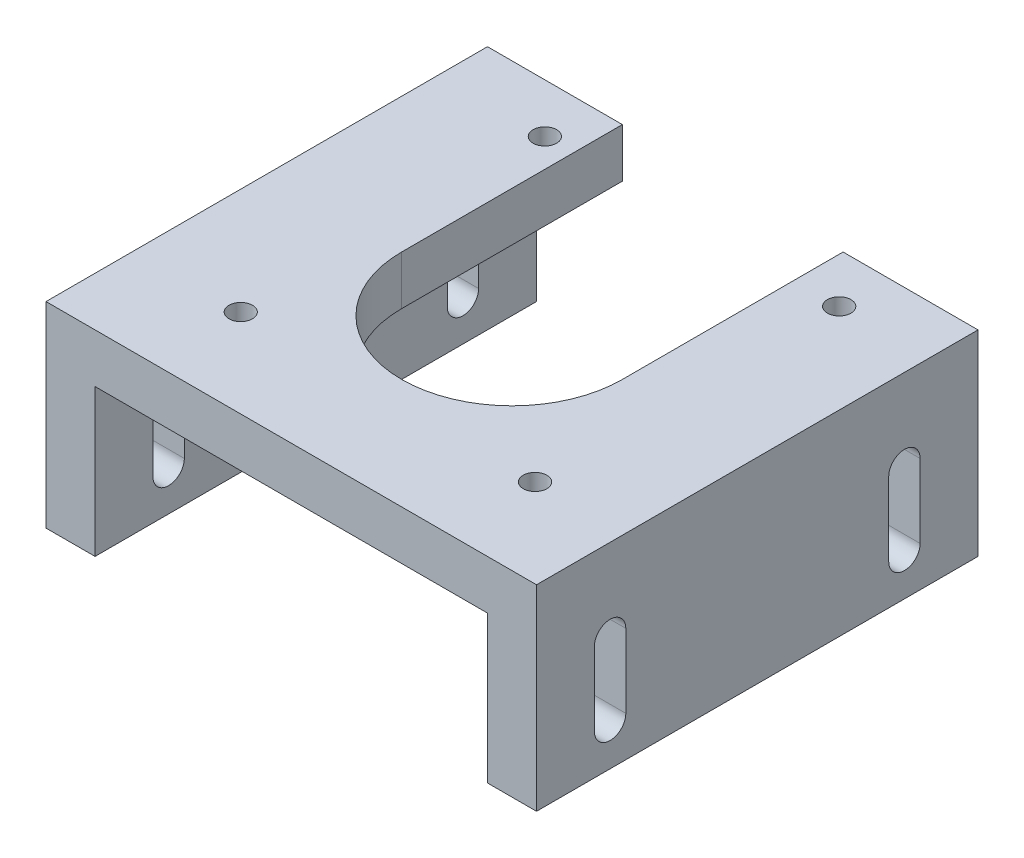
ISO-10303-21;
HEADER;
FILE_DESCRIPTION(('STEP AP214'),'2;1');
FILE_NAME('part.step','',(''),(''),'','','');
FILE_SCHEMA(('AUTOMOTIVE_DESIGN { 1 0 10303 214 1 1 1 1 }'));
ENDSEC;
DATA;
#1=APPLICATION_CONTEXT('core data for automotive mechanical design processes');
#2=APPLICATION_PROTOCOL_DEFINITION('international standard','automotive_design',2000,#1);
#3=PRODUCT_CONTEXT('',#1,'mechanical');
#4=PRODUCT('Part','Part','',(#3));
#5=PRODUCT_RELATED_PRODUCT_CATEGORY('part','',(#4));
#6=PRODUCT_DEFINITION_FORMATION('','',#4);
#7=PRODUCT_DEFINITION_CONTEXT('part definition',#1,'design');
#8=PRODUCT_DEFINITION('design','',#6,#7);
#9=PRODUCT_DEFINITION_SHAPE('','',#8);
#10=(LENGTH_UNIT() NAMED_UNIT(*) SI_UNIT(.MILLI.,.METRE.));
#11=(NAMED_UNIT(*) PLANE_ANGLE_UNIT() SI_UNIT($,.RADIAN.));
#12=(NAMED_UNIT(*) SI_UNIT($,.STERADIAN.) SOLID_ANGLE_UNIT());
#13=UNCERTAINTY_MEASURE_WITH_UNIT(LENGTH_MEASURE(1.E-05),#10,'distance_accuracy_value','');
#14=(GEOMETRIC_REPRESENTATION_CONTEXT(3) GLOBAL_UNCERTAINTY_ASSIGNED_CONTEXT((#13)) GLOBAL_UNIT_ASSIGNED_CONTEXT((#10,
#11,#12)) REPRESENTATION_CONTEXT('',''));
#15=CARTESIAN_POINT('',(0.,0.,0.));
#16=DIRECTION('',(0.,0.,1.));
#17=DIRECTION('',(1.,0.,0.));
#18=AXIS2_PLACEMENT_3D('',#15,#16,#17);
#19=CARTESIAN_POINT('',(0.,0.,0.));
#20=DIRECTION('',(0.,0.,1.));
#21=DIRECTION('',(1.,0.,0.));
#22=AXIS2_PLACEMENT_3D('',#19,#20,#21);
#23=PLANE('',#22);
#24=DIRECTION('',(1.,0.,0.));
#25=VECTOR('',#24,1.);
#26=CARTESIAN_POINT('',(-20.,15.,0.));
#27=LINE('',#26,#25);
#28=CARTESIAN_POINT('',(11.25,15.,0.));
#29=VERTEX_POINT('',#28);
#30=CARTESIAN_POINT('',(20.,15.,0.));
#31=VERTEX_POINT('',#30);
#32=EDGE_CURVE('E341',#29,#31,#27,.T.);
#33=ORIENTED_EDGE('',*,*,#32,.F.);
#34=DIRECTION('',(0.,1.,0.));
#35=VECTOR('',#34,1.);
#36=CARTESIAN_POINT('',(11.25,-0.001000000000001,0.));
#37=LINE('',#36,#35);
#38=CARTESIAN_POINT('',(11.25,20.,0.));
#39=VERTEX_POINT('',#38);
#40=EDGE_CURVE('E297',#29,#39,#37,.T.);
#41=ORIENTED_EDGE('',*,*,#40,.T.);
#42=DIRECTION('',(-1.,0.,0.));
#43=VECTOR('',#42,1.);
#44=CARTESIAN_POINT('',(25.,20.,0.));
#45=LINE('',#44,#43);
#46=CARTESIAN_POINT('',(25.,20.,0.));
#47=VERTEX_POINT('',#46);
#48=EDGE_CURVE('E332',#47,#39,#45,.T.);
#49=ORIENTED_EDGE('',*,*,#48,.F.);
#50=DIRECTION('',(0.,1.,0.));
#51=VECTOR('',#50,1.);
#52=CARTESIAN_POINT('',(25.,0.,0.));
#53=LINE('',#52,#51);
#54=CARTESIAN_POINT('',(25.,0.,0.));
#55=VERTEX_POINT('',#54);
#56=EDGE_CURVE('E329',#55,#47,#53,.T.);
#57=ORIENTED_EDGE('',*,*,#56,.F.);
#58=DIRECTION('',(1.,0.,0.));
#59=VECTOR('',#58,1.);
#60=CARTESIAN_POINT('',(20.,0.,0.));
#61=LINE('',#60,#59);
#62=CARTESIAN_POINT('',(20.,0.,0.));
#63=VERTEX_POINT('',#62);
#64=EDGE_CURVE('E307',#63,#55,#61,.T.);
#65=ORIENTED_EDGE('',*,*,#64,.F.);
#66=DIRECTION('',(0.,-1.,0.));
#67=VECTOR('',#66,1.);
#68=CARTESIAN_POINT('',(20.,15.,0.));
#69=LINE('',#68,#67);
#70=EDGE_CURVE('E312',#31,#63,#69,.T.);
#71=ORIENTED_EDGE('',*,*,#70,.F.);
#72=EDGE_LOOP('',(#33,#41,#49,#57,#65,#71));
#73=FACE_BOUND('',#72,.T.);
#74=ADVANCED_FACE('F35',(#73),#23,.F.);
#75=CARTESIAN_POINT('',(20.,0.,45.));
#76=DIRECTION('',(0.,1.,0.));
#77=DIRECTION('',(-1.,0.,0.));
#78=AXIS2_PLACEMENT_3D('',#75,#76,#77);
#79=PLANE('',#78);
#80=ORIENTED_EDGE('',*,*,#64,.T.);
#81=DIRECTION('',(0.,0.,-1.));
#82=VECTOR('',#81,1.);
#83=CARTESIAN_POINT('',(25.,0.,45.));
#84=LINE('',#83,#82);
#85=CARTESIAN_POINT('',(25.,0.,45.));
#86=VERTEX_POINT('',#85);
#87=EDGE_CURVE('E366',#86,#55,#84,.T.);
#88=ORIENTED_EDGE('',*,*,#87,.F.);
#89=DIRECTION('',(1.,0.,0.));
#90=VECTOR('',#89,1.);
#91=CARTESIAN_POINT('',(20.,0.,45.));
#92=LINE('',#91,#90);
#93=CARTESIAN_POINT('',(20.,0.,45.));
#94=VERTEX_POINT('',#93);
#95=EDGE_CURVE('E308',#94,#86,#92,.T.);
#96=ORIENTED_EDGE('',*,*,#95,.F.);
#97=DIRECTION('',(0.,0.,-1.));
#98=VECTOR('',#97,1.);
#99=CARTESIAN_POINT('',(20.,0.,45.));
#100=LINE('',#99,#98);
#101=EDGE_CURVE('E326',#94,#63,#100,.T.);
#102=ORIENTED_EDGE('',*,*,#101,.T.);
#103=EDGE_LOOP('',(#80,#88,#96,#102));
#104=FACE_BOUND('',#103,.T.);
#105=ADVANCED_FACE('F37',(#104),#79,.F.);
#106=CARTESIAN_POINT('',(25.,0.,45.));
#107=DIRECTION('',(-1.,0.,0.));
#108=DIRECTION('',(0.,0.,1.));
#109=AXIS2_PLACEMENT_3D('',#106,#107,#108);
#110=PLANE('',#109);
#111=DIRECTION('',(0.,1.,0.));
#112=VECTOR('',#111,1.);
#113=CARTESIAN_POINT('',(25.,11.6,39.1));
#114=LINE('',#113,#112);
#115=CARTESIAN_POINT('',(25.,11.6,39.1));
#116=VERTEX_POINT('',#115);
#117=CARTESIAN_POINT('',(25.,4.1,39.1));
#118=VERTEX_POINT('',#117);
#119=EDGE_CURVE('E254',#116,#118,#114,.F.);
#120=ORIENTED_EDGE('',*,*,#119,.F.);
#121=CARTESIAN_POINT('',(25.,11.6,37.5));
#122=DIRECTION('',(1.,0.,0.));
#123=DIRECTION('',(0.,0.,-1.));
#124=AXIS2_PLACEMENT_3D('',#121,#122,#123);
#125=CIRCLE('',#124,1.6);
#126=CARTESIAN_POINT('',(25.,11.6,35.9));
#127=VERTEX_POINT('',#126);
#128=EDGE_CURVE('E39',#127,#116,#125,.T.);
#129=ORIENTED_EDGE('',*,*,#128,.F.);
#130=DIRECTION('',(0.,1.,0.));
#131=VECTOR('',#130,1.);
#132=CARTESIAN_POINT('',(25.,11.6,35.9));
#133=LINE('',#132,#131);
#134=CARTESIAN_POINT('',(25.,4.1,35.9));
#135=VERTEX_POINT('',#134);
#136=EDGE_CURVE('E86',#135,#127,#133,.T.);
#137=ORIENTED_EDGE('',*,*,#136,.F.);
#138=CARTESIAN_POINT('',(25.,4.1,37.5));
#139=DIRECTION('',(1.,0.,0.));
#140=DIRECTION('',(0.,0.,-1.));
#141=AXIS2_PLACEMENT_3D('',#138,#139,#140);
#142=CIRCLE('',#141,1.6);
#143=EDGE_CURVE('E229',#118,#135,#142,.T.);
#144=ORIENTED_EDGE('',*,*,#143,.F.);
#145=EDGE_LOOP('',(#120,#129,#137,#144));
#146=FACE_BOUND('',#145,.T.);
#147=DIRECTION('',(0.,1.,0.));
#148=VECTOR('',#147,1.);
#149=CARTESIAN_POINT('',(25.,11.6,9.1));
#150=LINE('',#149,#148);
#151=CARTESIAN_POINT('',(25.,11.6,9.1));
#152=VERTEX_POINT('',#151);
#153=CARTESIAN_POINT('',(25.,4.1,9.1));
#154=VERTEX_POINT('',#153);
#155=EDGE_CURVE('E241',#152,#154,#150,.F.);
#156=ORIENTED_EDGE('',*,*,#155,.F.);
#157=CARTESIAN_POINT('',(25.,11.6,7.5));
#158=DIRECTION('',(1.,0.,0.));
#159=DIRECTION('',(0.,0.,-1.));
#160=AXIS2_PLACEMENT_3D('',#157,#158,#159);
#161=CIRCLE('',#160,1.6);
#162=CARTESIAN_POINT('',(25.,11.6,5.9));
#163=VERTEX_POINT('',#162);
#164=EDGE_CURVE('E251',#163,#152,#161,.T.);
#165=ORIENTED_EDGE('',*,*,#164,.F.);
#166=DIRECTION('',(0.,1.,0.));
#167=VECTOR('',#166,1.);
#168=CARTESIAN_POINT('',(25.,11.6,5.9));
#169=LINE('',#168,#167);
#170=CARTESIAN_POINT('',(25.,4.1,5.9));
#171=VERTEX_POINT('',#170);
#172=EDGE_CURVE('E247',#171,#163,#169,.T.);
#173=ORIENTED_EDGE('',*,*,#172,.F.);
#174=CARTESIAN_POINT('',(25.,4.1,7.5));
#175=DIRECTION('',(1.,0.,0.));
#176=DIRECTION('',(0.,0.,-1.));
#177=AXIS2_PLACEMENT_3D('',#174,#175,#176);
#178=CIRCLE('',#177,1.6);
#179=EDGE_CURVE('E191',#154,#171,#178,.T.);
#180=ORIENTED_EDGE('',*,*,#179,.F.);
#181=EDGE_LOOP('',(#156,#165,#173,#180));
#182=FACE_BOUND('',#181,.T.);
#183=ORIENTED_EDGE('',*,*,#56,.T.);
#184=DIRECTION('',(0.,0.,-1.));
#185=VECTOR('',#184,1.);
#186=CARTESIAN_POINT('',(25.,20.,45.));
#187=LINE('',#186,#185);
#188=CARTESIAN_POINT('',(25.,20.,45.));
#189=VERTEX_POINT('',#188);
#190=EDGE_CURVE('E363',#189,#47,#187,.T.);
#191=ORIENTED_EDGE('',*,*,#190,.F.);
#192=DIRECTION('',(0.,1.,0.));
#193=VECTOR('',#192,1.);
#194=CARTESIAN_POINT('',(25.,0.,45.));
#195=LINE('',#194,#193);
#196=EDGE_CURVE('E311',#86,#189,#195,.T.);
#197=ORIENTED_EDGE('',*,*,#196,.F.);
#198=ORIENTED_EDGE('',*,*,#87,.T.);
#199=EDGE_LOOP('',(#183,#191,#197,#198));
#200=FACE_BOUND('',#199,.T.);
#201=ADVANCED_FACE('F504',(#146,#182,#200),#110,.F.);
#202=CARTESIAN_POINT('',(25.,20.,45.));
#203=DIRECTION('',(0.,-1.,0.));
#204=DIRECTION('',(0.,0.,-1.));
#205=AXIS2_PLACEMENT_3D('',#202,#203,#204);
#206=PLANE('',#205);
#207=CARTESIAN_POINT('',(15.85,20.,5.));
#208=DIRECTION('',(0.,1.,0.));
#209=DIRECTION('',(0.,0.,1.));
#210=AXIS2_PLACEMENT_3D('',#207,#208,#209);
#211=CIRCLE('',#210,1.2);
#212=CARTESIAN_POINT('',(15.85,20.,6.2));
#213=VERTEX_POINT('',#212);
#214=EDGE_CURVE('E275',#213,#213,#211,.T.);
#215=ORIENTED_EDGE('',*,*,#214,.F.);
#216=EDGE_LOOP('',(#215));
#217=FACE_BOUND('',#216,.T.);
#218=CARTESIAN_POINT('',(-14.15,20.,5.));
#219=DIRECTION('',(0.,1.,0.));
#220=DIRECTION('',(0.,0.,1.));
#221=AXIS2_PLACEMENT_3D('',#218,#219,#220);
#222=CIRCLE('',#221,1.2);
#223=CARTESIAN_POINT('',(-14.15,20.,6.2));
#224=VERTEX_POINT('',#223);
#225=EDGE_CURVE('E272',#224,#224,#222,.T.);
#226=ORIENTED_EDGE('',*,*,#225,.F.);
#227=EDGE_LOOP('',(#226));
#228=FACE_BOUND('',#227,.T.);
#229=CARTESIAN_POINT('',(-14.15,20.,36.));
#230=DIRECTION('',(0.,1.,0.));
#231=DIRECTION('',(0.,0.,1.));
#232=AXIS2_PLACEMENT_3D('',#229,#230,#231);
#233=CIRCLE('',#232,1.2);
#234=CARTESIAN_POINT('',(-14.15,20.,37.2));
#235=VERTEX_POINT('',#234);
#236=EDGE_CURVE('E268',#235,#235,#233,.T.);
#237=ORIENTED_EDGE('',*,*,#236,.F.);
#238=EDGE_LOOP('',(#237));
#239=FACE_BOUND('',#238,.T.);
#240=CARTESIAN_POINT('',(15.85,20.,36.));
#241=DIRECTION('',(0.,1.,0.));
#242=DIRECTION('',(0.,0.,1.));
#243=AXIS2_PLACEMENT_3D('',#240,#241,#242);
#244=CIRCLE('',#243,1.2);
#245=CARTESIAN_POINT('',(15.85,20.,37.2));
#246=VERTEX_POINT('',#245);
#247=EDGE_CURVE('E271',#246,#246,#244,.T.);
#248=ORIENTED_EDGE('',*,*,#247,.F.);
#249=EDGE_LOOP('',(#248));
#250=FACE_BOUND('',#249,.T.);
#251=ORIENTED_EDGE('',*,*,#48,.T.);
#252=DIRECTION('',(0.,0.,-1.));
#253=VECTOR('',#252,1.);
#254=CARTESIAN_POINT('',(11.25,20.,0.));
#255=LINE('',#254,#253);
#256=CARTESIAN_POINT('',(11.25,20.,22.5));
#257=VERTEX_POINT('',#256);
#258=EDGE_CURVE('E294',#257,#39,#255,.T.);
#259=ORIENTED_EDGE('',*,*,#258,.F.);
#260=CARTESIAN_POINT('',(0.,20.,22.5));
#261=DIRECTION('',(0.,1.,0.));
#262=DIRECTION('',(0.,0.,-1.));
#263=AXIS2_PLACEMENT_3D('',#260,#261,#262);
#264=CIRCLE('',#263,11.25);
#265=CARTESIAN_POINT('',(-11.25,20.,22.5));
#266=VERTEX_POINT('',#265);
#267=EDGE_CURVE('E291',#266,#257,#264,.T.);
#268=ORIENTED_EDGE('',*,*,#267,.F.);
#269=DIRECTION('',(0.,0.,1.));
#270=VECTOR('',#269,1.);
#271=CARTESIAN_POINT('',(-11.25,20.,0.));
#272=LINE('',#271,#270);
#273=CARTESIAN_POINT('',(-11.25,20.,0.));
#274=VERTEX_POINT('',#273);
#275=EDGE_CURVE('E288',#274,#266,#272,.T.);
#276=ORIENTED_EDGE('',*,*,#275,.F.);
#277=CARTESIAN_POINT('',(-25.,20.,0.));
#278=VERTEX_POINT('',#277);
#279=EDGE_CURVE('E331',#274,#278,#45,.T.);
#280=ORIENTED_EDGE('',*,*,#279,.T.);
#281=DIRECTION('',(0.,0.,-1.));
#282=VECTOR('',#281,1.);
#283=CARTESIAN_POINT('',(-25.,20.,45.));
#284=LINE('',#283,#282);
#285=CARTESIAN_POINT('',(-25.,20.,45.));
#286=VERTEX_POINT('',#285);
#287=EDGE_CURVE('E360',#286,#278,#284,.T.);
#288=ORIENTED_EDGE('',*,*,#287,.F.);
#289=DIRECTION('',(-1.,0.,0.));
#290=VECTOR('',#289,1.);
#291=CARTESIAN_POINT('',(25.,20.,45.));
#292=LINE('',#291,#290);
#293=EDGE_CURVE('E314',#189,#286,#292,.T.);
#294=ORIENTED_EDGE('',*,*,#293,.F.);
#295=ORIENTED_EDGE('',*,*,#190,.T.);
#296=EDGE_LOOP('',(#251,#259,#268,#276,#280,#288,#294,#295));
#297=FACE_BOUND('',#296,.T.);
#298=ADVANCED_FACE('F529',(#217,#228,#239,#250,#297),#206,.F.);
#299=CARTESIAN_POINT('',(-25.,0.,45.));
#300=DIRECTION('',(1.,0.,0.));
#301=DIRECTION('',(0.,0.,-1.));
#302=AXIS2_PLACEMENT_3D('',#299,#300,#301);
#303=PLANE('',#302);
#304=DIRECTION('',(0.,1.,0.));
#305=VECTOR('',#304,1.);
#306=CARTESIAN_POINT('',(-25.,11.6,35.9));
#307=LINE('',#306,#305);
#308=CARTESIAN_POINT('',(-25.,4.1,35.9));
#309=VERTEX_POINT('',#308);
#310=CARTESIAN_POINT('',(-25.,11.6,35.9));
#311=VERTEX_POINT('',#310);
#312=EDGE_CURVE('E839',#309,#311,#307,.T.);
#313=ORIENTED_EDGE('',*,*,#312,.T.);
#314=CARTESIAN_POINT('',(-25.,11.6,37.5));
#315=DIRECTION('',(1.,0.,0.));
#316=DIRECTION('',(0.,0.,-1.));
#317=AXIS2_PLACEMENT_3D('',#314,#315,#316);
#318=CIRCLE('',#317,1.6);
#319=CARTESIAN_POINT('',(-25.,11.6,39.1));
#320=VERTEX_POINT('',#319);
#321=EDGE_CURVE('E401',#311,#320,#318,.T.);
#322=ORIENTED_EDGE('',*,*,#321,.T.);
#323=DIRECTION('',(0.,-1.,0.));
#324=VECTOR('',#323,1.);
#325=CARTESIAN_POINT('',(-25.,11.6,39.1));
#326=LINE('',#325,#324);
#327=CARTESIAN_POINT('',(-25.,4.1,39.1));
#328=VERTEX_POINT('',#327);
#329=EDGE_CURVE('E843',#320,#328,#326,.T.);
#330=ORIENTED_EDGE('',*,*,#329,.T.);
#331=CARTESIAN_POINT('',(-25.,4.1,37.5));
#332=DIRECTION('',(1.,0.,0.));
#333=DIRECTION('',(0.,0.,-1.));
#334=AXIS2_PLACEMENT_3D('',#331,#332,#333);
#335=CIRCLE('',#334,1.6);
#336=EDGE_CURVE('E438',#328,#309,#335,.T.);
#337=ORIENTED_EDGE('',*,*,#336,.T.);
#338=EDGE_LOOP('',(#313,#322,#330,#337));
#339=FACE_BOUND('',#338,.T.);
#340=DIRECTION('',(0.,1.,0.));
#341=VECTOR('',#340,1.);
#342=CARTESIAN_POINT('',(-25.,11.6,5.9));
#343=LINE('',#342,#341);
#344=CARTESIAN_POINT('',(-25.,4.1,5.9));
#345=VERTEX_POINT('',#344);
#346=CARTESIAN_POINT('',(-25.,11.6,5.9));
#347=VERTEX_POINT('',#346);
#348=EDGE_CURVE('E452',#345,#347,#343,.T.);
#349=ORIENTED_EDGE('',*,*,#348,.T.);
#350=CARTESIAN_POINT('',(-25.,11.6,7.5));
#351=DIRECTION('',(1.,0.,0.));
#352=DIRECTION('',(0.,0.,1.));
#353=AXIS2_PLACEMENT_3D('',#350,#351,#352);
#354=CIRCLE('',#353,1.6);
#355=CARTESIAN_POINT('',(-25.,11.6,9.1));
#356=VERTEX_POINT('',#355);
#357=EDGE_CURVE('E444',#347,#356,#354,.T.);
#358=ORIENTED_EDGE('',*,*,#357,.T.);
#359=DIRECTION('',(0.,-1.,0.));
#360=VECTOR('',#359,1.);
#361=CARTESIAN_POINT('',(-25.,11.6,9.1));
#362=LINE('',#361,#360);
#363=CARTESIAN_POINT('',(-25.,4.1,9.1));
#364=VERTEX_POINT('',#363);
#365=EDGE_CURVE('E447',#356,#364,#362,.T.);
#366=ORIENTED_EDGE('',*,*,#365,.T.);
#367=CARTESIAN_POINT('',(-25.,4.1,7.5));
#368=DIRECTION('',(1.,0.,0.));
#369=DIRECTION('',(0.,0.,1.));
#370=AXIS2_PLACEMENT_3D('',#367,#368,#369);
#371=CIRCLE('',#370,1.6);
#372=EDGE_CURVE('E450',#364,#345,#371,.T.);
#373=ORIENTED_EDGE('',*,*,#372,.T.);
#374=EDGE_LOOP('',(#349,#358,#366,#373));
#375=FACE_BOUND('',#374,.T.);
#376=DIRECTION('',(0.,-1.,0.));
#377=VECTOR('',#376,1.);
#378=CARTESIAN_POINT('',(-25.,0.,0.));
#379=LINE('',#378,#377);
#380=CARTESIAN_POINT('',(-25.,0.,0.));
#381=VERTEX_POINT('',#380);
#382=EDGE_CURVE('E335',#278,#381,#379,.T.);
#383=ORIENTED_EDGE('',*,*,#382,.T.);
#384=DIRECTION('',(0.,0.,-1.));
#385=VECTOR('',#384,1.);
#386=CARTESIAN_POINT('',(-25.,0.,45.));
#387=LINE('',#386,#385);
#388=CARTESIAN_POINT('',(-25.,0.,45.));
#389=VERTEX_POINT('',#388);
#390=EDGE_CURVE('E357',#389,#381,#387,.T.);
#391=ORIENTED_EDGE('',*,*,#390,.F.);
#392=DIRECTION('',(0.,-1.,0.));
#393=VECTOR('',#392,1.);
#394=CARTESIAN_POINT('',(-25.,0.,45.));
#395=LINE('',#394,#393);
#396=EDGE_CURVE('E316',#286,#389,#395,.T.);
#397=ORIENTED_EDGE('',*,*,#396,.F.);
#398=ORIENTED_EDGE('',*,*,#287,.T.);
#399=EDGE_LOOP('',(#383,#391,#397,#398));
#400=FACE_BOUND('',#399,.T.);
#401=ADVANCED_FACE('F457',(#339,#375,#400),#303,.F.);
#402=CARTESIAN_POINT('',(-25.,0.,45.));
#403=DIRECTION('',(0.,1.,0.));
#404=DIRECTION('',(0.,0.,1.));
#405=AXIS2_PLACEMENT_3D('',#402,#403,#404);
#406=PLANE('',#405);
#407=DIRECTION('',(1.,0.,0.));
#408=VECTOR('',#407,1.);
#409=CARTESIAN_POINT('',(-25.,0.,0.));
#410=LINE('',#409,#408);
#411=CARTESIAN_POINT('',(-20.,0.,0.));
#412=VERTEX_POINT('',#411);
#413=EDGE_CURVE('E337',#381,#412,#410,.T.);
#414=ORIENTED_EDGE('',*,*,#413,.T.);
#415=DIRECTION('',(0.,0.,-1.));
#416=VECTOR('',#415,1.);
#417=CARTESIAN_POINT('',(-20.,0.,45.));
#418=LINE('',#417,#416);
#419=CARTESIAN_POINT('',(-20.,0.,45.));
#420=VERTEX_POINT('',#419);
#421=EDGE_CURVE('E354',#420,#412,#418,.T.);
#422=ORIENTED_EDGE('',*,*,#421,.F.);
#423=DIRECTION('',(1.,0.,0.));
#424=VECTOR('',#423,1.);
#425=CARTESIAN_POINT('',(-25.,0.,45.));
#426=LINE('',#425,#424);
#427=EDGE_CURVE('E318',#389,#420,#426,.T.);
#428=ORIENTED_EDGE('',*,*,#427,.F.);
#429=ORIENTED_EDGE('',*,*,#390,.T.);
#430=EDGE_LOOP('',(#414,#422,#428,#429));
#431=FACE_BOUND('',#430,.T.);
#432=ADVANCED_FACE('F589',(#431),#406,.F.);
#433=CARTESIAN_POINT('',(-20.,15.,45.));
#434=DIRECTION('',(-1.,0.,0.));
#435=DIRECTION('',(0.,-1.,0.));
#436=AXIS2_PLACEMENT_3D('',#433,#434,#435);
#437=PLANE('',#436);
#438=DIRECTION('',(0.,1.,0.));
#439=VECTOR('',#438,1.);
#440=CARTESIAN_POINT('',(-20.,15.,39.1));
#441=LINE('',#440,#439);
#442=CARTESIAN_POINT('',(-20.,4.1,39.1));
#443=VERTEX_POINT('',#442);
#444=CARTESIAN_POINT('',(-20.,11.6,39.1));
#445=VERTEX_POINT('',#444);
#446=EDGE_CURVE('E253',#443,#445,#441,.T.);
#447=ORIENTED_EDGE('',*,*,#446,.T.);
#448=CARTESIAN_POINT('',(-20.,11.6,37.5));
#449=DIRECTION('',(-1.,0.,0.));
#450=DIRECTION('',(0.,-1.,0.));
#451=AXIS2_PLACEMENT_3D('',#448,#449,#450);
#452=CIRCLE('',#451,1.6);
#453=CARTESIAN_POINT('',(-20.,11.6,35.9));
#454=VERTEX_POINT('',#453);
#455=EDGE_CURVE('E258',#445,#454,#452,.T.);
#456=ORIENTED_EDGE('',*,*,#455,.T.);
#457=DIRECTION('',(0.,-1.,0.));
#458=VECTOR('',#457,1.);
#459=CARTESIAN_POINT('',(-20.,15.,35.9));
#460=LINE('',#459,#458);
#461=CARTESIAN_POINT('',(-20.,4.1,35.9));
#462=VERTEX_POINT('',#461);
#463=EDGE_CURVE('E257',#454,#462,#460,.T.);
#464=ORIENTED_EDGE('',*,*,#463,.T.);
#465=CARTESIAN_POINT('',(-20.,4.1,37.5));
#466=DIRECTION('',(-1.,0.,0.));
#467=DIRECTION('',(0.,-1.,0.));
#468=AXIS2_PLACEMENT_3D('',#465,#466,#467);
#469=CIRCLE('',#468,1.6);
#470=EDGE_CURVE('E256',#462,#443,#469,.T.);
#471=ORIENTED_EDGE('',*,*,#470,.T.);
#472=EDGE_LOOP('',(#447,#456,#464,#471));
#473=FACE_BOUND('',#472,.T.);
#474=DIRECTION('',(0.,1.,0.));
#475=VECTOR('',#474,1.);
#476=CARTESIAN_POINT('',(-20.,15.,9.1));
#477=LINE('',#476,#475);
#478=CARTESIAN_POINT('',(-20.,4.1,9.1));
#479=VERTEX_POINT('',#478);
#480=CARTESIAN_POINT('',(-20.,11.6,9.1));
#481=VERTEX_POINT('',#480);
#482=EDGE_CURVE('E244',#479,#481,#477,.T.);
#483=ORIENTED_EDGE('',*,*,#482,.T.);
#484=CARTESIAN_POINT('',(-20.,11.6,7.5));
#485=DIRECTION('',(-1.,0.,0.));
#486=DIRECTION('',(0.,-1.,0.));
#487=AXIS2_PLACEMENT_3D('',#484,#485,#486);
#488=CIRCLE('',#487,1.6);
#489=CARTESIAN_POINT('',(-20.,11.6,5.9));
#490=VERTEX_POINT('',#489);
#491=EDGE_CURVE('E250',#481,#490,#488,.T.);
#492=ORIENTED_EDGE('',*,*,#491,.T.);
#493=DIRECTION('',(0.,-1.,0.));
#494=VECTOR('',#493,1.);
#495=CARTESIAN_POINT('',(-20.,15.,5.90000000000001));
#496=LINE('',#495,#494);
#497=CARTESIAN_POINT('',(-20.,4.1,5.9));
#498=VERTEX_POINT('',#497);
#499=EDGE_CURVE('E246',#490,#498,#496,.T.);
#500=ORIENTED_EDGE('',*,*,#499,.T.);
#501=CARTESIAN_POINT('',(-20.,4.1,7.5));
#502=DIRECTION('',(-1.,0.,0.));
#503=DIRECTION('',(0.,-1.,0.));
#504=AXIS2_PLACEMENT_3D('',#501,#502,#503);
#505=CIRCLE('',#504,1.6);
#506=EDGE_CURVE('E243',#498,#479,#505,.T.);
#507=ORIENTED_EDGE('',*,*,#506,.T.);
#508=EDGE_LOOP('',(#483,#492,#500,#507));
#509=FACE_BOUND('',#508,.T.);
#510=DIRECTION('',(0.,1.,0.));
#511=VECTOR('',#510,1.);
#512=CARTESIAN_POINT('',(-20.,15.,0.));
#513=LINE('',#512,#511);
#514=CARTESIAN_POINT('',(-20.,15.,0.));
#515=VERTEX_POINT('',#514);
#516=EDGE_CURVE('E339',#412,#515,#513,.T.);
#517=ORIENTED_EDGE('',*,*,#516,.T.);
#518=DIRECTION('',(0.,0.,-1.));
#519=VECTOR('',#518,1.);
#520=CARTESIAN_POINT('',(-20.,15.,45.));
#521=LINE('',#520,#519);
#522=CARTESIAN_POINT('',(-20.,15.,45.));
#523=VERTEX_POINT('',#522);
#524=EDGE_CURVE('E351',#523,#515,#521,.T.);
#525=ORIENTED_EDGE('',*,*,#524,.F.);
#526=DIRECTION('',(0.,1.,0.));
#527=VECTOR('',#526,1.);
#528=CARTESIAN_POINT('',(-20.,15.,45.));
#529=LINE('',#528,#527);
#530=EDGE_CURVE('E320',#420,#523,#529,.T.);
#531=ORIENTED_EDGE('',*,*,#530,.F.);
#532=ORIENTED_EDGE('',*,*,#421,.T.);
#533=EDGE_LOOP('',(#517,#525,#531,#532));
#534=FACE_BOUND('',#533,.T.);
#535=ADVANCED_FACE('F422',(#473,#509,#534),#437,.F.);
#536=CARTESIAN_POINT('',(-20.,15.,45.));
#537=DIRECTION('',(0.,1.,0.));
#538=DIRECTION('',(0.,0.,1.));
#539=AXIS2_PLACEMENT_3D('',#536,#537,#538);
#540=PLANE('',#539);
#541=CARTESIAN_POINT('',(15.85,15.,5.));
#542=DIRECTION('',(0.,1.,0.));
#543=DIRECTION('',(0.,0.,1.));
#544=AXIS2_PLACEMENT_3D('',#541,#542,#543);
#545=CIRCLE('',#544,1.2);
#546=CARTESIAN_POINT('',(15.85,15.,6.2));
#547=VERTEX_POINT('',#546);
#548=EDGE_CURVE('E285',#547,#547,#545,.T.);
#549=ORIENTED_EDGE('',*,*,#548,.T.);
#550=EDGE_LOOP('',(#549));
#551=FACE_BOUND('',#550,.T.);
#552=CARTESIAN_POINT('',(-14.15,15.,5.));
#553=DIRECTION('',(0.,1.,0.));
#554=DIRECTION('',(0.,0.,1.));
#555=AXIS2_PLACEMENT_3D('',#552,#553,#554);
#556=CIRCLE('',#555,1.2);
#557=CARTESIAN_POINT('',(-14.15,15.,6.2));
#558=VERTEX_POINT('',#557);
#559=EDGE_CURVE('E375',#558,#558,#556,.T.);
#560=ORIENTED_EDGE('',*,*,#559,.T.);
#561=EDGE_LOOP('',(#560));
#562=FACE_BOUND('',#561,.T.);
#563=CARTESIAN_POINT('',(-14.15,15.,36.));
#564=DIRECTION('',(0.,1.,0.));
#565=DIRECTION('',(0.,0.,1.));
#566=AXIS2_PLACEMENT_3D('',#563,#564,#565);
#567=CIRCLE('',#566,1.2);
#568=CARTESIAN_POINT('',(-14.15,15.,37.2));
#569=VERTEX_POINT('',#568);
#570=EDGE_CURVE('E372',#569,#569,#567,.T.);
#571=ORIENTED_EDGE('',*,*,#570,.T.);
#572=EDGE_LOOP('',(#571));
#573=FACE_BOUND('',#572,.T.);
#574=CARTESIAN_POINT('',(15.85,15.,36.));
#575=DIRECTION('',(0.,1.,0.));
#576=DIRECTION('',(0.,0.,1.));
#577=AXIS2_PLACEMENT_3D('',#574,#575,#576);
#578=CIRCLE('',#577,1.2);
#579=CARTESIAN_POINT('',(15.85,15.,37.2));
#580=VERTEX_POINT('',#579);
#581=EDGE_CURVE('E280',#580,#580,#578,.T.);
#582=ORIENTED_EDGE('',*,*,#581,.T.);
#583=EDGE_LOOP('',(#582));
#584=FACE_BOUND('',#583,.T.);
#585=CARTESIAN_POINT('',(0.,15.,22.5));
#586=DIRECTION('',(0.,1.,0.));
#587=DIRECTION('',(0.,0.,1.));
#588=AXIS2_PLACEMENT_3D('',#585,#586,#587);
#589=CIRCLE('',#588,11.25);
#590=CARTESIAN_POINT('',(11.25,15.,22.5));
#591=VERTEX_POINT('',#590);
#592=CARTESIAN_POINT('',(-11.25,15.,22.5));
#593=VERTEX_POINT('',#592);
#594=EDGE_CURVE('E281',#591,#593,#589,.F.);
#595=ORIENTED_EDGE('',*,*,#594,.F.);
#596=DIRECTION('',(0.,0.,1.));
#597=VECTOR('',#596,1.);
#598=CARTESIAN_POINT('',(11.25,15.,0.));
#599=LINE('',#598,#597);
#600=EDGE_CURVE('E284',#29,#591,#599,.T.);
#601=ORIENTED_EDGE('',*,*,#600,.F.);
#602=ORIENTED_EDGE('',*,*,#32,.T.);
#603=DIRECTION('',(0.,0.,-1.));
#604=VECTOR('',#603,1.);
#605=CARTESIAN_POINT('',(20.,15.,45.));
#606=LINE('',#605,#604);
#607=CARTESIAN_POINT('',(20.,15.,45.));
#608=VERTEX_POINT('',#607);
#609=EDGE_CURVE('E348',#608,#31,#606,.T.);
#610=ORIENTED_EDGE('',*,*,#609,.F.);
#611=DIRECTION('',(1.,0.,0.));
#612=VECTOR('',#611,1.);
#613=CARTESIAN_POINT('',(-20.,15.,45.));
#614=LINE('',#613,#612);
#615=EDGE_CURVE('E322',#523,#608,#614,.T.);
#616=ORIENTED_EDGE('',*,*,#615,.F.);
#617=ORIENTED_EDGE('',*,*,#524,.T.);
#618=CARTESIAN_POINT('',(-11.25,15.,0.));
#619=VERTEX_POINT('',#618);
#620=EDGE_CURVE('E342',#515,#619,#27,.T.);
#621=ORIENTED_EDGE('',*,*,#620,.T.);
#622=DIRECTION('',(0.,0.,-1.));
#623=VECTOR('',#622,1.);
#624=CARTESIAN_POINT('',(-11.25,15.,0.));
#625=LINE('',#624,#623);
#626=EDGE_CURVE('E300',#593,#619,#625,.T.);
#627=ORIENTED_EDGE('',*,*,#626,.F.);
#628=EDGE_LOOP('',(#595,#601,#602,#610,#616,#617,#621,#627));
#629=FACE_BOUND('',#628,.T.);
#630=ADVANCED_FACE('F545',(#551,#562,#573,#584,#629),#540,.F.);
#631=CARTESIAN_POINT('',(20.,15.,45.));
#632=DIRECTION('',(1.,0.,0.));
#633=DIRECTION('',(0.,1.,0.));
#634=AXIS2_PLACEMENT_3D('',#631,#632,#633);
#635=PLANE('',#634);
#636=DIRECTION('',(0.,1.,0.));
#637=VECTOR('',#636,1.);
#638=CARTESIAN_POINT('',(20.,15.,35.9));
#639=LINE('',#638,#637);
#640=CARTESIAN_POINT('',(20.,4.1,35.9));
#641=VERTEX_POINT('',#640);
#642=CARTESIAN_POINT('',(20.,11.6,35.9));
#643=VERTEX_POINT('',#642);
#644=EDGE_CURVE('E44',#641,#643,#639,.T.);
#645=ORIENTED_EDGE('',*,*,#644,.T.);
#646=CARTESIAN_POINT('',(20.,11.6,37.5));
#647=DIRECTION('',(1.,0.,0.));
#648=DIRECTION('',(0.,1.,0.));
#649=AXIS2_PLACEMENT_3D('',#646,#647,#648);
#650=CIRCLE('',#649,1.6);
#651=CARTESIAN_POINT('',(20.,11.6,39.1));
#652=VERTEX_POINT('',#651);
#653=EDGE_CURVE('E11',#643,#652,#650,.T.);
#654=ORIENTED_EDGE('',*,*,#653,.T.);
#655=DIRECTION('',(0.,-1.,0.));
#656=VECTOR('',#655,1.);
#657=CARTESIAN_POINT('',(20.,15.,39.1));
#658=LINE('',#657,#656);
#659=CARTESIAN_POINT('',(20.,4.1,39.1));
#660=VERTEX_POINT('',#659);
#661=EDGE_CURVE('E235',#652,#660,#658,.T.);
#662=ORIENTED_EDGE('',*,*,#661,.T.);
#663=CARTESIAN_POINT('',(20.,4.1,37.5));
#664=DIRECTION('',(1.,0.,0.));
#665=DIRECTION('',(0.,1.,0.));
#666=AXIS2_PLACEMENT_3D('',#663,#664,#665);
#667=CIRCLE('',#666,1.6);
#668=EDGE_CURVE('E221',#660,#641,#667,.T.);
#669=ORIENTED_EDGE('',*,*,#668,.T.);
#670=EDGE_LOOP('',(#645,#654,#662,#669));
#671=FACE_BOUND('',#670,.T.);
#672=DIRECTION('',(0.,1.,0.));
#673=VECTOR('',#672,1.);
#674=CARTESIAN_POINT('',(20.,15.,5.90000000000001));
#675=LINE('',#674,#673);
#676=CARTESIAN_POINT('',(20.,4.1,5.9));
#677=VERTEX_POINT('',#676);
#678=CARTESIAN_POINT('',(20.,11.6,5.9));
#679=VERTEX_POINT('',#678);
#680=EDGE_CURVE('E201',#677,#679,#675,.T.);
#681=ORIENTED_EDGE('',*,*,#680,.T.);
#682=CARTESIAN_POINT('',(20.,11.6,7.5));
#683=DIRECTION('',(1.,0.,0.));
#684=DIRECTION('',(0.,1.,0.));
#685=AXIS2_PLACEMENT_3D('',#682,#683,#684);
#686=CIRCLE('',#685,1.6);
#687=CARTESIAN_POINT('',(20.,11.6,9.1));
#688=VERTEX_POINT('',#687);
#689=EDGE_CURVE('E237',#679,#688,#686,.T.);
#690=ORIENTED_EDGE('',*,*,#689,.T.);
#691=DIRECTION('',(0.,-1.,0.));
#692=VECTOR('',#691,1.);
#693=CARTESIAN_POINT('',(20.,15.,9.1));
#694=LINE('',#693,#692);
#695=CARTESIAN_POINT('',(20.,4.1,9.1));
#696=VERTEX_POINT('',#695);
#697=EDGE_CURVE('E369',#688,#696,#694,.T.);
#698=ORIENTED_EDGE('',*,*,#697,.T.);
#699=CARTESIAN_POINT('',(20.,4.1,7.5));
#700=DIRECTION('',(1.,0.,0.));
#701=DIRECTION('',(0.,1.,0.));
#702=AXIS2_PLACEMENT_3D('',#699,#700,#701);
#703=CIRCLE('',#702,1.6);
#704=EDGE_CURVE('E382',#696,#677,#703,.T.);
#705=ORIENTED_EDGE('',*,*,#704,.T.);
#706=EDGE_LOOP('',(#681,#690,#698,#705));
#707=FACE_BOUND('',#706,.T.);
#708=ORIENTED_EDGE('',*,*,#70,.T.);
#709=ORIENTED_EDGE('',*,*,#101,.F.);
#710=DIRECTION('',(0.,-1.,0.));
#711=VECTOR('',#710,1.);
#712=CARTESIAN_POINT('',(20.,15.,45.));
#713=LINE('',#712,#711);
#714=EDGE_CURVE('E324',#608,#94,#713,.T.);
#715=ORIENTED_EDGE('',*,*,#714,.F.);
#716=ORIENTED_EDGE('',*,*,#609,.T.);
#717=EDGE_LOOP('',(#708,#709,#715,#716));
#718=FACE_BOUND('',#717,.T.);
#719=ADVANCED_FACE('F233',(#671,#707,#718),#635,.F.);
#720=CARTESIAN_POINT('',(0.,0.,45.));
#721=DIRECTION('',(0.,0.,1.));
#722=DIRECTION('',(1.,0.,0.));
#723=AXIS2_PLACEMENT_3D('',#720,#721,#722);
#724=PLANE('',#723);
#725=ORIENTED_EDGE('',*,*,#95,.T.);
#726=ORIENTED_EDGE('',*,*,#196,.T.);
#727=ORIENTED_EDGE('',*,*,#293,.T.);
#728=ORIENTED_EDGE('',*,*,#396,.T.);
#729=ORIENTED_EDGE('',*,*,#427,.T.);
#730=ORIENTED_EDGE('',*,*,#530,.T.);
#731=ORIENTED_EDGE('',*,*,#615,.T.);
#732=ORIENTED_EDGE('',*,*,#714,.T.);
#733=EDGE_LOOP('',(#725,#726,#727,#728,#729,#730,#731,#732));
#734=FACE_BOUND('',#733,.T.);
#735=ADVANCED_FACE('F511',(#734),#724,.T.);
#736=ORIENTED_EDGE('',*,*,#279,.F.);
#737=DIRECTION('',(0.,1.,0.));
#738=VECTOR('',#737,1.);
#739=CARTESIAN_POINT('',(-11.25,-0.001000000000001,0.));
#740=LINE('',#739,#738);
#741=EDGE_CURVE('E296',#619,#274,#740,.T.);
#742=ORIENTED_EDGE('',*,*,#741,.F.);
#743=ORIENTED_EDGE('',*,*,#620,.F.);
#744=ORIENTED_EDGE('',*,*,#516,.F.);
#745=ORIENTED_EDGE('',*,*,#413,.F.);
#746=ORIENTED_EDGE('',*,*,#382,.F.);
#747=EDGE_LOOP('',(#736,#742,#743,#744,#745,#746));
#748=FACE_BOUND('',#747,.T.);
#749=ADVANCED_FACE('F500',(#748),#23,.F.);
#750=CARTESIAN_POINT('',(11.25,-0.001000000000001,0.));
#751=DIRECTION('',(1.,0.,0.));
#752=DIRECTION('',(0.,0.,-1.));
#753=AXIS2_PLACEMENT_3D('',#750,#751,#752);
#754=PLANE('',#753);
#755=ORIENTED_EDGE('',*,*,#600,.T.);
#756=DIRECTION('',(0.,1.,0.));
#757=VECTOR('',#756,1.);
#758=CARTESIAN_POINT('',(11.25,-0.001000000000001,22.5));
#759=LINE('',#758,#757);
#760=EDGE_CURVE('E301',#591,#257,#759,.T.);
#761=ORIENTED_EDGE('',*,*,#760,.T.);
#762=ORIENTED_EDGE('',*,*,#258,.T.);
#763=ORIENTED_EDGE('',*,*,#40,.F.);
#764=EDGE_LOOP('',(#755,#761,#762,#763));
#765=FACE_BOUND('',#764,.T.);
#766=ADVANCED_FACE('F510',(#765),#754,.F.);
#767=CARTESIAN_POINT('',(0.,-0.001000000000001,22.5));
#768=DIRECTION('',(0.,1.,0.));
#769=DIRECTION('',(0.,0.,1.));
#770=AXIS2_PLACEMENT_3D('',#767,#768,#769);
#771=CYLINDRICAL_SURFACE('',#770,11.25);
#772=ORIENTED_EDGE('',*,*,#594,.T.);
#773=DIRECTION('',(0.,1.,0.));
#774=VECTOR('',#773,1.);
#775=CARTESIAN_POINT('',(-11.25,-0.001000000000001,22.5));
#776=LINE('',#775,#774);
#777=EDGE_CURVE('E303',#593,#266,#776,.T.);
#778=ORIENTED_EDGE('',*,*,#777,.T.);
#779=ORIENTED_EDGE('',*,*,#267,.T.);
#780=ORIENTED_EDGE('',*,*,#760,.F.);
#781=EDGE_LOOP('',(#772,#778,#779,#780));
#782=FACE_BOUND('',#781,.T.);
#783=ADVANCED_FACE('F517',(#782),#771,.F.);
#784=CARTESIAN_POINT('',(-11.25,-0.001000000000001,0.));
#785=DIRECTION('',(-1.,0.,0.));
#786=DIRECTION('',(0.,0.,1.));
#787=AXIS2_PLACEMENT_3D('',#784,#785,#786);
#788=PLANE('',#787);
#789=ORIENTED_EDGE('',*,*,#626,.T.);
#790=ORIENTED_EDGE('',*,*,#741,.T.);
#791=ORIENTED_EDGE('',*,*,#275,.T.);
#792=ORIENTED_EDGE('',*,*,#777,.F.);
#793=EDGE_LOOP('',(#789,#790,#791,#792));
#794=FACE_BOUND('',#793,.T.);
#795=ADVANCED_FACE('F550',(#794),#788,.F.);
#796=CARTESIAN_POINT('',(15.85,9.99999999999999,36.));
#797=DIRECTION('',(0.,1.,0.));
#798=DIRECTION('',(0.,0.,1.));
#799=AXIS2_PLACEMENT_3D('',#796,#797,#798);
#800=CYLINDRICAL_SURFACE('',#799,1.2);
#801=ORIENTED_EDGE('',*,*,#247,.T.);
#802=EDGE_LOOP('',(#801));
#803=FACE_BOUND('',#802,.T.);
#804=ORIENTED_EDGE('',*,*,#581,.F.);
#805=EDGE_LOOP('',(#804));
#806=FACE_BOUND('',#805,.T.);
#807=ADVANCED_FACE('F552',(#803,#806),#800,.F.);
#808=CARTESIAN_POINT('',(-14.15,9.99999999999999,36.));
#809=DIRECTION('',(0.,1.,0.));
#810=DIRECTION('',(0.,0.,1.));
#811=AXIS2_PLACEMENT_3D('',#808,#809,#810);
#812=CYLINDRICAL_SURFACE('',#811,1.2);
#813=ORIENTED_EDGE('',*,*,#236,.T.);
#814=EDGE_LOOP('',(#813));
#815=FACE_BOUND('',#814,.T.);
#816=ORIENTED_EDGE('',*,*,#570,.F.);
#817=EDGE_LOOP('',(#816));
#818=FACE_BOUND('',#817,.T.);
#819=ADVANCED_FACE('F558',(#815,#818),#812,.F.);
#820=CARTESIAN_POINT('',(-14.15,9.99999999999999,5.));
#821=DIRECTION('',(0.,1.,0.));
#822=DIRECTION('',(0.,0.,1.));
#823=AXIS2_PLACEMENT_3D('',#820,#821,#822);
#824=CYLINDRICAL_SURFACE('',#823,1.2);
#825=ORIENTED_EDGE('',*,*,#225,.T.);
#826=EDGE_LOOP('',(#825));
#827=FACE_BOUND('',#826,.T.);
#828=ORIENTED_EDGE('',*,*,#559,.F.);
#829=EDGE_LOOP('',(#828));
#830=FACE_BOUND('',#829,.T.);
#831=ADVANCED_FACE('F567',(#827,#830),#824,.F.);
#832=CARTESIAN_POINT('',(15.85,9.99999999999999,5.));
#833=DIRECTION('',(0.,1.,0.));
#834=DIRECTION('',(0.,0.,1.));
#835=AXIS2_PLACEMENT_3D('',#832,#833,#834);
#836=CYLINDRICAL_SURFACE('',#835,1.2);
#837=ORIENTED_EDGE('',*,*,#214,.T.);
#838=EDGE_LOOP('',(#837));
#839=FACE_BOUND('',#838,.T.);
#840=ORIENTED_EDGE('',*,*,#548,.F.);
#841=EDGE_LOOP('',(#840));
#842=FACE_BOUND('',#841,.T.);
#843=ADVANCED_FACE('F563',(#839,#842),#836,.F.);
#844=CARTESIAN_POINT('',(-25.,11.6,9.1));
#845=DIRECTION('',(0.,0.,1.));
#846=DIRECTION('',(1.,0.,0.));
#847=AXIS2_PLACEMENT_3D('',#844,#845,#846);
#848=PLANE('',#847);
#849=DIRECTION('',(1.,0.,0.));
#850=VECTOR('',#849,1.);
#851=CARTESIAN_POINT('',(-25.,4.1,9.1));
#852=LINE('',#851,#850);
#853=EDGE_CURVE('E409',#696,#154,#852,.T.);
#854=ORIENTED_EDGE('',*,*,#853,.F.);
#855=ORIENTED_EDGE('',*,*,#697,.F.);
#856=DIRECTION('',(1.,0.,0.));
#857=VECTOR('',#856,1.);
#858=CARTESIAN_POINT('',(-25.,11.6,9.1));
#859=LINE('',#858,#857);
#860=EDGE_CURVE('E61',#688,#152,#859,.T.);
#861=ORIENTED_EDGE('',*,*,#860,.T.);
#862=ORIENTED_EDGE('',*,*,#155,.T.);
#863=EDGE_LOOP('',(#854,#855,#861,#862));
#864=FACE_BOUND('',#863,.T.);
#865=ADVANCED_FACE('F566',(#864),#848,.F.);
#866=CARTESIAN_POINT('',(-25.,4.1,7.5));
#867=DIRECTION('',(1.,0.,0.));
#868=DIRECTION('',(0.,0.,-1.));
#869=AXIS2_PLACEMENT_3D('',#866,#867,#868);
#870=CYLINDRICAL_SURFACE('',#869,1.6);
#871=DIRECTION('',(1.,0.,0.));
#872=VECTOR('',#871,1.);
#873=CARTESIAN_POINT('',(-25.,4.1,5.9));
#874=LINE('',#873,#872);
#875=EDGE_CURVE('E403',#677,#171,#874,.T.);
#876=ORIENTED_EDGE('',*,*,#875,.F.);
#877=ORIENTED_EDGE('',*,*,#704,.F.);
#878=ORIENTED_EDGE('',*,*,#853,.T.);
#879=ORIENTED_EDGE('',*,*,#179,.T.);
#880=EDGE_LOOP('',(#876,#877,#878,#879));
#881=FACE_BOUND('',#880,.T.);
#882=ADVANCED_FACE('F618',(#881),#870,.F.);
#883=CARTESIAN_POINT('',(-25.,11.6,5.9));
#884=DIRECTION('',(0.,0.,-1.));
#885=DIRECTION('',(-1.,0.,0.));
#886=AXIS2_PLACEMENT_3D('',#883,#884,#885);
#887=PLANE('',#886);
#888=DIRECTION('',(1.,0.,0.));
#889=VECTOR('',#888,1.);
#890=CARTESIAN_POINT('',(-25.,11.6,5.9));
#891=LINE('',#890,#889);
#892=EDGE_CURVE('E393',#679,#163,#891,.T.);
#893=ORIENTED_EDGE('',*,*,#892,.F.);
#894=ORIENTED_EDGE('',*,*,#680,.F.);
#895=ORIENTED_EDGE('',*,*,#875,.T.);
#896=ORIENTED_EDGE('',*,*,#172,.T.);
#897=EDGE_LOOP('',(#893,#894,#895,#896));
#898=FACE_BOUND('',#897,.T.);
#899=ADVANCED_FACE('F395',(#898),#887,.F.);
#900=CARTESIAN_POINT('',(-25.,11.6,7.5));
#901=DIRECTION('',(1.,0.,0.));
#902=DIRECTION('',(0.,0.,-1.));
#903=AXIS2_PLACEMENT_3D('',#900,#901,#902);
#904=CYLINDRICAL_SURFACE('',#903,1.6);
#905=ORIENTED_EDGE('',*,*,#860,.F.);
#906=ORIENTED_EDGE('',*,*,#689,.F.);
#907=ORIENTED_EDGE('',*,*,#892,.T.);
#908=ORIENTED_EDGE('',*,*,#164,.T.);
#909=EDGE_LOOP('',(#905,#906,#907,#908));
#910=FACE_BOUND('',#909,.T.);
#911=ADVANCED_FACE('F392',(#910),#904,.F.);
#912=CARTESIAN_POINT('',(-25.,11.6,39.1));
#913=DIRECTION('',(0.,0.,1.));
#914=DIRECTION('',(1.,0.,0.));
#915=AXIS2_PLACEMENT_3D('',#912,#913,#914);
#916=PLANE('',#915);
#917=DIRECTION('',(1.,0.,0.));
#918=VECTOR('',#917,1.);
#919=CARTESIAN_POINT('',(-25.,4.1,39.1));
#920=LINE('',#919,#918);
#921=EDGE_CURVE('E439',#660,#118,#920,.T.);
#922=ORIENTED_EDGE('',*,*,#921,.F.);
#923=ORIENTED_EDGE('',*,*,#661,.F.);
#924=DIRECTION('',(1.,0.,0.));
#925=VECTOR('',#924,1.);
#926=CARTESIAN_POINT('',(-25.,11.6,39.1));
#927=LINE('',#926,#925);
#928=EDGE_CURVE('E52',#652,#116,#927,.T.);
#929=ORIENTED_EDGE('',*,*,#928,.T.);
#930=ORIENTED_EDGE('',*,*,#119,.T.);
#931=EDGE_LOOP('',(#922,#923,#929,#930));
#932=FACE_BOUND('',#931,.T.);
#933=ADVANCED_FACE('F496',(#932),#916,.F.);
#934=CARTESIAN_POINT('',(-25.,4.1,37.5));
#935=DIRECTION('',(1.,0.,0.));
#936=DIRECTION('',(0.,0.,-1.));
#937=AXIS2_PLACEMENT_3D('',#934,#935,#936);
#938=CYLINDRICAL_SURFACE('',#937,1.6);
#939=DIRECTION('',(1.,0.,0.));
#940=VECTOR('',#939,1.);
#941=CARTESIAN_POINT('',(-25.,4.1,35.9));
#942=LINE('',#941,#940);
#943=EDGE_CURVE('E217',#641,#135,#942,.T.);
#944=ORIENTED_EDGE('',*,*,#943,.F.);
#945=ORIENTED_EDGE('',*,*,#668,.F.);
#946=ORIENTED_EDGE('',*,*,#921,.T.);
#947=ORIENTED_EDGE('',*,*,#143,.T.);
#948=EDGE_LOOP('',(#944,#945,#946,#947));
#949=FACE_BOUND('',#948,.T.);
#950=ADVANCED_FACE('F225',(#949),#938,.F.);
#951=CARTESIAN_POINT('',(-25.,11.6,35.9));
#952=DIRECTION('',(0.,0.,-1.));
#953=DIRECTION('',(-1.,0.,0.));
#954=AXIS2_PLACEMENT_3D('',#951,#952,#953);
#955=PLANE('',#954);
#956=DIRECTION('',(1.,0.,0.));
#957=VECTOR('',#956,1.);
#958=CARTESIAN_POINT('',(-25.,11.6,35.9));
#959=LINE('',#958,#957);
#960=EDGE_CURVE('E218',#643,#127,#959,.T.);
#961=ORIENTED_EDGE('',*,*,#960,.F.);
#962=ORIENTED_EDGE('',*,*,#644,.F.);
#963=ORIENTED_EDGE('',*,*,#943,.T.);
#964=ORIENTED_EDGE('',*,*,#136,.T.);
#965=EDGE_LOOP('',(#961,#962,#963,#964));
#966=FACE_BOUND('',#965,.T.);
#967=ADVANCED_FACE('F216',(#966),#955,.F.);
#968=CARTESIAN_POINT('',(-25.,11.6,37.5));
#969=DIRECTION('',(1.,0.,0.));
#970=DIRECTION('',(0.,0.,-1.));
#971=AXIS2_PLACEMENT_3D('',#968,#969,#970);
#972=CYLINDRICAL_SURFACE('',#971,1.6);
#973=ORIENTED_EDGE('',*,*,#928,.F.);
#974=ORIENTED_EDGE('',*,*,#653,.F.);
#975=ORIENTED_EDGE('',*,*,#960,.T.);
#976=ORIENTED_EDGE('',*,*,#128,.T.);
#977=EDGE_LOOP('',(#973,#974,#975,#976));
#978=FACE_BOUND('',#977,.T.);
#979=ADVANCED_FACE('F484',(#978),#972,.F.);
#980=EDGE_CURVE('E407',#356,#481,#859,.T.);
#981=ORIENTED_EDGE('',*,*,#980,.F.);
#982=ORIENTED_EDGE('',*,*,#357,.F.);
#983=EDGE_CURVE('E397',#347,#490,#891,.T.);
#984=ORIENTED_EDGE('',*,*,#983,.T.);
#985=ORIENTED_EDGE('',*,*,#491,.F.);
#986=EDGE_LOOP('',(#981,#982,#984,#985));
#987=FACE_BOUND('',#986,.T.);
#988=ADVANCED_FACE('F482',(#987),#904,.F.);
#989=ORIENTED_EDGE('',*,*,#983,.F.);
#990=ORIENTED_EDGE('',*,*,#348,.F.);
#991=EDGE_CURVE('E398',#345,#498,#874,.T.);
#992=ORIENTED_EDGE('',*,*,#991,.T.);
#993=ORIENTED_EDGE('',*,*,#499,.F.);
#994=EDGE_LOOP('',(#989,#990,#992,#993));
#995=FACE_BOUND('',#994,.T.);
#996=ADVANCED_FACE('F466',(#995),#887,.F.);
#997=ORIENTED_EDGE('',*,*,#991,.F.);
#998=ORIENTED_EDGE('',*,*,#372,.F.);
#999=EDGE_CURVE('E410',#364,#479,#852,.T.);
#1000=ORIENTED_EDGE('',*,*,#999,.T.);
#1001=ORIENTED_EDGE('',*,*,#506,.F.);
#1002=EDGE_LOOP('',(#997,#998,#1000,#1001));
#1003=FACE_BOUND('',#1002,.T.);
#1004=ADVANCED_FACE('F479',(#1003),#870,.F.);
#1005=ORIENTED_EDGE('',*,*,#999,.F.);
#1006=ORIENTED_EDGE('',*,*,#365,.F.);
#1007=ORIENTED_EDGE('',*,*,#980,.T.);
#1008=ORIENTED_EDGE('',*,*,#482,.F.);
#1009=EDGE_LOOP('',(#1005,#1006,#1007,#1008));
#1010=FACE_BOUND('',#1009,.T.);
#1011=ADVANCED_FACE('F476',(#1010),#848,.F.);
#1012=EDGE_CURVE('E432',#320,#445,#927,.T.);
#1013=ORIENTED_EDGE('',*,*,#1012,.F.);
#1014=ORIENTED_EDGE('',*,*,#321,.F.);
#1015=EDGE_CURVE('E415',#311,#454,#959,.T.);
#1016=ORIENTED_EDGE('',*,*,#1015,.T.);
#1017=ORIENTED_EDGE('',*,*,#455,.F.);
#1018=EDGE_LOOP('',(#1013,#1014,#1016,#1017));
#1019=FACE_BOUND('',#1018,.T.);
#1020=ADVANCED_FACE('F492',(#1019),#972,.F.);
#1021=ORIENTED_EDGE('',*,*,#1015,.F.);
#1022=ORIENTED_EDGE('',*,*,#312,.F.);
#1023=EDGE_CURVE('E230',#309,#462,#942,.T.);
#1024=ORIENTED_EDGE('',*,*,#1023,.T.);
#1025=ORIENTED_EDGE('',*,*,#463,.F.);
#1026=EDGE_LOOP('',(#1021,#1022,#1024,#1025));
#1027=FACE_BOUND('',#1026,.T.);
#1028=ADVANCED_FACE('F632',(#1027),#955,.F.);
#1029=ORIENTED_EDGE('',*,*,#1023,.F.);
#1030=ORIENTED_EDGE('',*,*,#336,.F.);
#1031=EDGE_CURVE('E231',#328,#443,#920,.T.);
#1032=ORIENTED_EDGE('',*,*,#1031,.T.);
#1033=ORIENTED_EDGE('',*,*,#470,.F.);
#1034=EDGE_LOOP('',(#1029,#1030,#1032,#1033));
#1035=FACE_BOUND('',#1034,.T.);
#1036=ADVANCED_FACE('F435',(#1035),#938,.F.);
#1037=ORIENTED_EDGE('',*,*,#1031,.F.);
#1038=ORIENTED_EDGE('',*,*,#329,.F.);
#1039=ORIENTED_EDGE('',*,*,#1012,.T.);
#1040=ORIENTED_EDGE('',*,*,#446,.F.);
#1041=EDGE_LOOP('',(#1037,#1038,#1039,#1040));
#1042=FACE_BOUND('',#1041,.T.);
#1043=ADVANCED_FACE('F428',(#1042),#916,.F.);
#1044=CLOSED_SHELL('',(#74,#105,#201,#298,#401,#432,#535,#630,#719,#735,#749,#766,#783,#795,
#807,#819,#831,#843,#865,#882,#899,#911,#933,#950,#967,#979,#988,#996,#1004,#1011,#1020,#1028,
#1036,#1043));
#1045=MANIFOLD_SOLID_BREP('B2',#1044);
#1046=ADVANCED_BREP_SHAPE_REPRESENTATION('',(#18,#1045),#14);
#1047=SHAPE_DEFINITION_REPRESENTATION(#9,#1046);
ENDSEC;
END-ISO-10303-21;
